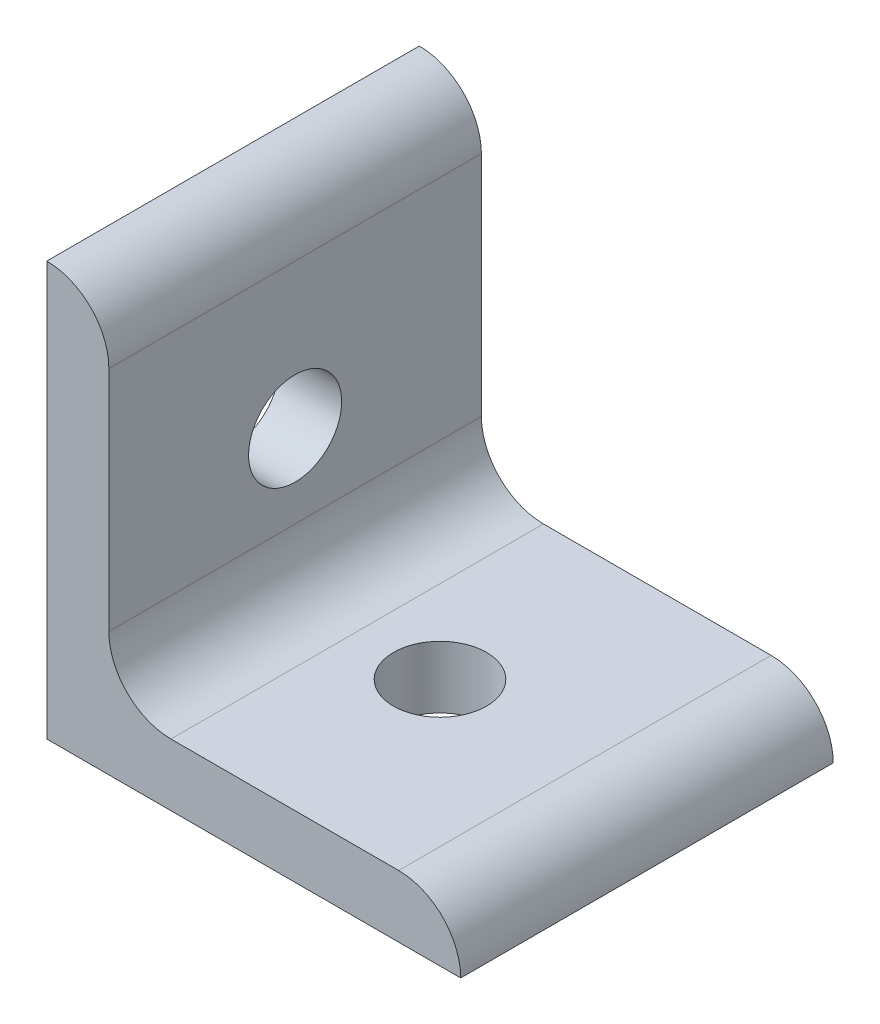
ISO-10303-21;
HEADER;
FILE_DESCRIPTION(('STEP AP214'),'2;1');
FILE_NAME('part.step','',(''),(''),'','','');
FILE_SCHEMA(('AUTOMOTIVE_DESIGN { 1 0 10303 214 1 1 1 1 }'));
ENDSEC;
DATA;
#1=APPLICATION_CONTEXT('core data for automotive mechanical design processes');
#2=APPLICATION_PROTOCOL_DEFINITION('international standard','automotive_design',2000,#1);
#3=PRODUCT_CONTEXT('',#1,'mechanical');
#4=PRODUCT('Part','Part','',(#3));
#5=PRODUCT_RELATED_PRODUCT_CATEGORY('part','',(#4));
#6=PRODUCT_DEFINITION_FORMATION('','',#4);
#7=PRODUCT_DEFINITION_CONTEXT('part definition',#1,'design');
#8=PRODUCT_DEFINITION('design','',#6,#7);
#9=PRODUCT_DEFINITION_SHAPE('','',#8);
#10=(LENGTH_UNIT() NAMED_UNIT(*) SI_UNIT(.MILLI.,.METRE.));
#11=(NAMED_UNIT(*) PLANE_ANGLE_UNIT() SI_UNIT($,.RADIAN.));
#12=(NAMED_UNIT(*) SI_UNIT($,.STERADIAN.) SOLID_ANGLE_UNIT());
#13=UNCERTAINTY_MEASURE_WITH_UNIT(LENGTH_MEASURE(1.E-05),#10,'distance_accuracy_value','');
#14=(GEOMETRIC_REPRESENTATION_CONTEXT(3) GLOBAL_UNCERTAINTY_ASSIGNED_CONTEXT((#13)) GLOBAL_UNIT_ASSIGNED_CONTEXT((#10,
#11,#12)) REPRESENTATION_CONTEXT('',''));
#15=CARTESIAN_POINT('',(0.,0.,0.));
#16=DIRECTION('',(0.,0.,1.));
#17=DIRECTION('',(1.,0.,0.));
#18=AXIS2_PLACEMENT_3D('',#15,#16,#17);
#19=CARTESIAN_POINT('',(6.,34.,18.));
#20=DIRECTION('',(-1.,0.,0.));
#21=DIRECTION('',(0.,-1.,0.));
#22=AXIS2_PLACEMENT_3D('',#19,#20,#21);
#23=PLANE('',#22);
#24=DIRECTION('',(0.,1.,0.));
#25=VECTOR('',#24,1.);
#26=CARTESIAN_POINT('',(6.,34.,-18.));
#27=LINE('',#26,#25);
#28=CARTESIAN_POINT('',(6.,12.,-18.));
#29=VERTEX_POINT('',#28);
#30=CARTESIAN_POINT('',(6.,34.,-18.));
#31=VERTEX_POINT('',#30);
#32=EDGE_CURVE('E117',#29,#31,#27,.T.);
#33=ORIENTED_EDGE('',*,*,#32,.T.);
#34=DIRECTION('',(0.,0.,-1.));
#35=VECTOR('',#34,1.);
#36=CARTESIAN_POINT('',(6.,34.,18.));
#37=LINE('',#36,#35);
#38=CARTESIAN_POINT('',(6.,34.,18.));
#39=VERTEX_POINT('',#38);
#40=EDGE_CURVE('E114',#39,#31,#37,.T.);
#41=ORIENTED_EDGE('',*,*,#40,.F.);
#42=DIRECTION('',(0.,1.,0.));
#43=VECTOR('',#42,1.);
#44=CARTESIAN_POINT('',(6.,34.,18.));
#45=LINE('',#44,#43);
#46=CARTESIAN_POINT('',(6.,12.,18.));
#47=VERTEX_POINT('',#46);
#48=EDGE_CURVE('E103',#47,#39,#45,.T.);
#49=ORIENTED_EDGE('',*,*,#48,.F.);
#50=DIRECTION('',(0.,0.,-1.));
#51=VECTOR('',#50,1.);
#52=CARTESIAN_POINT('',(6.,12.,18.));
#53=LINE('',#52,#51);
#54=EDGE_CURVE('E118',#47,#29,#53,.T.);
#55=ORIENTED_EDGE('',*,*,#54,.T.);
#56=EDGE_LOOP('',(#33,#41,#49,#55));
#57=FACE_BOUND('',#56,.T.);
#58=CARTESIAN_POINT('',(6.,20.,0.));
#59=DIRECTION('',(-1.,0.,0.));
#60=DIRECTION('',(0.,-1.,0.));
#61=AXIS2_PLACEMENT_3D('',#58,#59,#60);
#62=CIRCLE('',#61,4.5);
#63=CARTESIAN_POINT('',(6.,15.5,0.));
#64=VERTEX_POINT('',#63);
#65=EDGE_CURVE('E167',#64,#64,#62,.F.);
#66=ORIENTED_EDGE('',*,*,#65,.F.);
#67=EDGE_LOOP('',(#66));
#68=FACE_BOUND('',#67,.T.);
#69=ADVANCED_FACE('F35',(#57,#68),#23,.F.);
#70=CARTESIAN_POINT('',(0.,0.,18.));
#71=DIRECTION('',(1.,0.,0.));
#72=DIRECTION('',(0.,0.,-1.));
#73=AXIS2_PLACEMENT_3D('',#70,#71,#72);
#74=PLANE('',#73);
#75=DIRECTION('',(0.,-1.,0.));
#76=VECTOR('',#75,1.);
#77=CARTESIAN_POINT('',(0.,0.,-18.));
#78=LINE('',#77,#76);
#79=CARTESIAN_POINT('',(0.,40.,-18.));
#80=VERTEX_POINT('',#79);
#81=CARTESIAN_POINT('',(0.,0.,-18.));
#82=VERTEX_POINT('',#81);
#83=EDGE_CURVE('E85',#80,#82,#78,.T.);
#84=ORIENTED_EDGE('',*,*,#83,.T.);
#85=DIRECTION('',(0.,0.,-1.));
#86=VECTOR('',#85,1.);
#87=CARTESIAN_POINT('',(0.,0.,18.));
#88=LINE('',#87,#86);
#89=CARTESIAN_POINT('',(0.,0.,18.));
#90=VERTEX_POINT('',#89);
#91=EDGE_CURVE('E123',#90,#82,#88,.T.);
#92=ORIENTED_EDGE('',*,*,#91,.F.);
#93=DIRECTION('',(0.,-1.,0.));
#94=VECTOR('',#93,1.);
#95=CARTESIAN_POINT('',(0.,0.,18.));
#96=LINE('',#95,#94);
#97=CARTESIAN_POINT('',(0.,40.,18.));
#98=VERTEX_POINT('',#97);
#99=EDGE_CURVE('E53',#98,#90,#96,.T.);
#100=ORIENTED_EDGE('',*,*,#99,.F.);
#101=DIRECTION('',(0.,0.,-1.));
#102=VECTOR('',#101,1.);
#103=CARTESIAN_POINT('',(0.,40.,18.));
#104=LINE('',#103,#102);
#105=EDGE_CURVE('E119',#98,#80,#104,.T.);
#106=ORIENTED_EDGE('',*,*,#105,.T.);
#107=EDGE_LOOP('',(#84,#92,#100,#106));
#108=FACE_BOUND('',#107,.T.);
#109=CARTESIAN_POINT('',(0.,20.,0.));
#110=DIRECTION('',(1.,0.,0.));
#111=DIRECTION('',(0.,0.,-1.));
#112=AXIS2_PLACEMENT_3D('',#109,#110,#111);
#113=CIRCLE('',#112,4.5);
#114=CARTESIAN_POINT('',(0.,20.,-4.5));
#115=VERTEX_POINT('',#114);
#116=EDGE_CURVE('E170',#115,#115,#113,.T.);
#117=ORIENTED_EDGE('',*,*,#116,.T.);
#118=EDGE_LOOP('',(#117));
#119=FACE_BOUND('',#118,.T.);
#120=ADVANCED_FACE('F174',(#108,#119),#74,.F.);
#121=CARTESIAN_POINT('',(40.,0.,18.));
#122=DIRECTION('',(0.,1.,0.));
#123=DIRECTION('',(-1.,0.,0.));
#124=AXIS2_PLACEMENT_3D('',#121,#122,#123);
#125=PLANE('',#124);
#126=DIRECTION('',(1.,0.,0.));
#127=VECTOR('',#126,1.);
#128=CARTESIAN_POINT('',(40.,0.,-18.));
#129=LINE('',#128,#127);
#130=CARTESIAN_POINT('',(40.,0.,-18.));
#131=VERTEX_POINT('',#130);
#132=EDGE_CURVE('E127',#82,#131,#129,.T.);
#133=ORIENTED_EDGE('',*,*,#132,.T.);
#134=DIRECTION('',(0.,0.,-1.));
#135=VECTOR('',#134,1.);
#136=CARTESIAN_POINT('',(40.,0.,18.));
#137=LINE('',#136,#135);
#138=CARTESIAN_POINT('',(40.,0.,18.));
#139=VERTEX_POINT('',#138);
#140=EDGE_CURVE('E11',#139,#131,#137,.T.);
#141=ORIENTED_EDGE('',*,*,#140,.F.);
#142=DIRECTION('',(1.,0.,0.));
#143=VECTOR('',#142,1.);
#144=CARTESIAN_POINT('',(40.,0.,18.));
#145=LINE('',#144,#143);
#146=EDGE_CURVE('E139',#90,#139,#145,.T.);
#147=ORIENTED_EDGE('',*,*,#146,.F.);
#148=ORIENTED_EDGE('',*,*,#91,.T.);
#149=EDGE_LOOP('',(#133,#141,#147,#148));
#150=FACE_BOUND('',#149,.T.);
#151=CARTESIAN_POINT('',(20.,0.,0.));
#152=DIRECTION('',(0.,1.,0.));
#153=DIRECTION('',(0.,0.,1.));
#154=AXIS2_PLACEMENT_3D('',#151,#152,#153);
#155=CIRCLE('',#154,4.5);
#156=CARTESIAN_POINT('',(20.,0.,4.5));
#157=VERTEX_POINT('',#156);
#158=EDGE_CURVE('E164',#157,#157,#155,.T.);
#159=ORIENTED_EDGE('',*,*,#158,.T.);
#160=EDGE_LOOP('',(#159));
#161=FACE_BOUND('',#160,.T.);
#162=ADVANCED_FACE('F37',(#150,#161),#125,.F.);
#163=CARTESIAN_POINT('',(12.,6.,18.));
#164=DIRECTION('',(0.,-1.,0.));
#165=DIRECTION('',(0.,0.,-1.));
#166=AXIS2_PLACEMENT_3D('',#163,#164,#165);
#167=PLANE('',#166);
#168=DIRECTION('',(-1.,0.,0.));
#169=VECTOR('',#168,1.);
#170=CARTESIAN_POINT('',(12.,6.,-18.));
#171=LINE('',#170,#169);
#172=CARTESIAN_POINT('',(34.,6.,-18.));
#173=VERTEX_POINT('',#172);
#174=CARTESIAN_POINT('',(12.,6.,-18.));
#175=VERTEX_POINT('',#174);
#176=EDGE_CURVE('E132',#173,#175,#171,.T.);
#177=ORIENTED_EDGE('',*,*,#176,.T.);
#178=DIRECTION('',(0.,0.,-1.));
#179=VECTOR('',#178,1.);
#180=CARTESIAN_POINT('',(12.,6.,18.));
#181=LINE('',#180,#179);
#182=CARTESIAN_POINT('',(12.,6.,18.));
#183=VERTEX_POINT('',#182);
#184=EDGE_CURVE('E143',#183,#175,#181,.T.);
#185=ORIENTED_EDGE('',*,*,#184,.F.);
#186=DIRECTION('',(-1.,0.,0.));
#187=VECTOR('',#186,1.);
#188=CARTESIAN_POINT('',(12.,6.,18.));
#189=LINE('',#188,#187);
#190=CARTESIAN_POINT('',(34.,6.,18.));
#191=VERTEX_POINT('',#190);
#192=EDGE_CURVE('E153',#191,#183,#189,.T.);
#193=ORIENTED_EDGE('',*,*,#192,.F.);
#194=DIRECTION('',(0.,0.,-1.));
#195=VECTOR('',#194,1.);
#196=CARTESIAN_POINT('',(34.,6.,18.));
#197=LINE('',#196,#195);
#198=EDGE_CURVE('E45',#191,#173,#197,.T.);
#199=ORIENTED_EDGE('',*,*,#198,.T.);
#200=EDGE_LOOP('',(#177,#185,#193,#199));
#201=FACE_BOUND('',#200,.T.);
#202=CARTESIAN_POINT('',(20.,6.00000000000001,0.));
#203=DIRECTION('',(0.,-1.,0.));
#204=DIRECTION('',(0.,0.,-1.));
#205=AXIS2_PLACEMENT_3D('',#202,#203,#204);
#206=CIRCLE('',#205,4.5);
#207=CARTESIAN_POINT('',(20.,6.00000000000001,-4.5));
#208=VERTEX_POINT('',#207);
#209=EDGE_CURVE('E39',#208,#208,#206,.F.);
#210=ORIENTED_EDGE('',*,*,#209,.F.);
#211=EDGE_LOOP('',(#210));
#212=FACE_BOUND('',#211,.T.);
#213=ADVANCED_FACE('F150',(#201,#212),#167,.F.);
#214=CARTESIAN_POINT('',(34.,0.,18.));
#215=DIRECTION('',(0.,0.,-1.));
#216=DIRECTION('',(-1.,0.,0.));
#217=AXIS2_PLACEMENT_3D('',#214,#215,#216);
#218=CYLINDRICAL_SURFACE('',#217,6.);
#219=CARTESIAN_POINT('',(34.,0.,-18.));
#220=DIRECTION('',(0.,0.,1.));
#221=DIRECTION('',(1.,0.,0.));
#222=AXIS2_PLACEMENT_3D('',#219,#220,#221);
#223=CIRCLE('',#222,6.);
#224=EDGE_CURVE('E130',#131,#173,#223,.T.);
#225=ORIENTED_EDGE('',*,*,#224,.T.);
#226=ORIENTED_EDGE('',*,*,#198,.F.);
#227=CARTESIAN_POINT('',(34.,0.,18.));
#228=DIRECTION('',(0.,0.,1.));
#229=DIRECTION('',(1.,0.,0.));
#230=AXIS2_PLACEMENT_3D('',#227,#228,#229);
#231=CIRCLE('',#230,6.);
#232=EDGE_CURVE('E93',#139,#191,#231,.T.);
#233=ORIENTED_EDGE('',*,*,#232,.F.);
#234=ORIENTED_EDGE('',*,*,#140,.T.);
#235=EDGE_LOOP('',(#225,#226,#233,#234));
#236=FACE_BOUND('',#235,.T.);
#237=ADVANCED_FACE('F192',(#236),#218,.T.);
#238=CARTESIAN_POINT('',(12.,12.,18.));
#239=DIRECTION('',(0.,0.,-1.));
#240=DIRECTION('',(-1.,0.,0.));
#241=AXIS2_PLACEMENT_3D('',#238,#239,#240);
#242=CYLINDRICAL_SURFACE('',#241,6.);
#243=CARTESIAN_POINT('',(12.,12.,-18.));
#244=DIRECTION('',(0.,0.,-1.));
#245=DIRECTION('',(1.,0.,0.));
#246=AXIS2_PLACEMENT_3D('',#243,#244,#245);
#247=CIRCLE('',#246,6.);
#248=EDGE_CURVE('E134',#175,#29,#247,.T.);
#249=ORIENTED_EDGE('',*,*,#248,.T.);
#250=ORIENTED_EDGE('',*,*,#54,.F.);
#251=CARTESIAN_POINT('',(12.,12.,18.));
#252=DIRECTION('',(0.,0.,-1.));
#253=DIRECTION('',(1.,0.,0.));
#254=AXIS2_PLACEMENT_3D('',#251,#252,#253);
#255=CIRCLE('',#254,6.);
#256=EDGE_CURVE('E109',#183,#47,#255,.T.);
#257=ORIENTED_EDGE('',*,*,#256,.F.);
#258=ORIENTED_EDGE('',*,*,#184,.T.);
#259=EDGE_LOOP('',(#249,#250,#257,#258));
#260=FACE_BOUND('',#259,.T.);
#261=ADVANCED_FACE('F159',(#260),#242,.F.);
#262=CARTESIAN_POINT('',(0.,34.,18.));
#263=DIRECTION('',(0.,0.,-1.));
#264=DIRECTION('',(-1.,0.,0.));
#265=AXIS2_PLACEMENT_3D('',#262,#263,#264);
#266=CYLINDRICAL_SURFACE('',#265,6.);
#267=CARTESIAN_POINT('',(0.,34.,-18.));
#268=DIRECTION('',(0.,0.,1.));
#269=DIRECTION('',(1.,0.,0.));
#270=AXIS2_PLACEMENT_3D('',#267,#268,#269);
#271=CIRCLE('',#270,6.);
#272=EDGE_CURVE('E79',#31,#80,#271,.T.);
#273=ORIENTED_EDGE('',*,*,#272,.T.);
#274=ORIENTED_EDGE('',*,*,#105,.F.);
#275=CARTESIAN_POINT('',(0.,34.,18.));
#276=DIRECTION('',(0.,0.,1.));
#277=DIRECTION('',(1.,0.,0.));
#278=AXIS2_PLACEMENT_3D('',#275,#276,#277);
#279=CIRCLE('',#278,6.);
#280=EDGE_CURVE('E107',#39,#98,#279,.T.);
#281=ORIENTED_EDGE('',*,*,#280,.F.);
#282=ORIENTED_EDGE('',*,*,#40,.T.);
#283=EDGE_LOOP('',(#273,#274,#281,#282));
#284=FACE_BOUND('',#283,.T.);
#285=ADVANCED_FACE('F121',(#284),#266,.T.);
#286=CARTESIAN_POINT('',(0.,34.,18.));
#287=DIRECTION('',(0.,0.,1.));
#288=DIRECTION('',(1.,0.,0.));
#289=AXIS2_PLACEMENT_3D('',#286,#287,#288);
#290=PLANE('',#289);
#291=ORIENTED_EDGE('',*,*,#146,.T.);
#292=ORIENTED_EDGE('',*,*,#232,.T.);
#293=ORIENTED_EDGE('',*,*,#192,.T.);
#294=ORIENTED_EDGE('',*,*,#256,.T.);
#295=ORIENTED_EDGE('',*,*,#48,.T.);
#296=ORIENTED_EDGE('',*,*,#280,.T.);
#297=ORIENTED_EDGE('',*,*,#99,.T.);
#298=EDGE_LOOP('',(#291,#292,#293,#294,#295,#296,#297));
#299=FACE_BOUND('',#298,.T.);
#300=ADVANCED_FACE('F105',(#299),#290,.T.);
#301=CARTESIAN_POINT('',(0.,34.,-18.));
#302=DIRECTION('',(0.,0.,1.));
#303=DIRECTION('',(1.,0.,0.));
#304=AXIS2_PLACEMENT_3D('',#301,#302,#303);
#305=PLANE('',#304);
#306=ORIENTED_EDGE('',*,*,#132,.F.);
#307=ORIENTED_EDGE('',*,*,#83,.F.);
#308=ORIENTED_EDGE('',*,*,#272,.F.);
#309=ORIENTED_EDGE('',*,*,#32,.F.);
#310=ORIENTED_EDGE('',*,*,#248,.F.);
#311=ORIENTED_EDGE('',*,*,#176,.F.);
#312=ORIENTED_EDGE('',*,*,#224,.F.);
#313=EDGE_LOOP('',(#306,#307,#308,#309,#310,#311,#312));
#314=FACE_BOUND('',#313,.T.);
#315=ADVANCED_FACE('F157',(#314),#305,.F.);
#316=CARTESIAN_POINT('',(20.,40.,0.));
#317=DIRECTION('',(0.,-1.,0.));
#318=DIRECTION('',(0.,0.,-1.));
#319=AXIS2_PLACEMENT_3D('',#316,#317,#318);
#320=CYLINDRICAL_SURFACE('',#319,4.5);
#321=ORIENTED_EDGE('',*,*,#158,.F.);
#322=EDGE_LOOP('',(#321));
#323=FACE_BOUND('',#322,.T.);
#324=ORIENTED_EDGE('',*,*,#209,.T.);
#325=EDGE_LOOP('',(#324));
#326=FACE_BOUND('',#325,.T.);
#327=ADVANCED_FACE('F179',(#323,#326),#320,.F.);
#328=CARTESIAN_POINT('',(40.,20.,0.));
#329=DIRECTION('',(-1.,0.,0.));
#330=DIRECTION('',(0.,0.,1.));
#331=AXIS2_PLACEMENT_3D('',#328,#329,#330);
#332=CYLINDRICAL_SURFACE('',#331,4.5);
#333=ORIENTED_EDGE('',*,*,#116,.F.);
#334=EDGE_LOOP('',(#333));
#335=FACE_BOUND('',#334,.T.);
#336=ORIENTED_EDGE('',*,*,#65,.T.);
#337=EDGE_LOOP('',(#336));
#338=FACE_BOUND('',#337,.T.);
#339=ADVANCED_FACE('F176',(#335,#338),#332,.F.);
#340=CLOSED_SHELL('',(#69,#120,#162,#213,#237,#261,#285,#300,#315,#327,#339));
#341=MANIFOLD_SOLID_BREP('B2',#340);
#342=ADVANCED_BREP_SHAPE_REPRESENTATION('',(#18,#341),#14);
#343=SHAPE_DEFINITION_REPRESENTATION(#9,#342);
ENDSEC;
END-ISO-10303-21;
